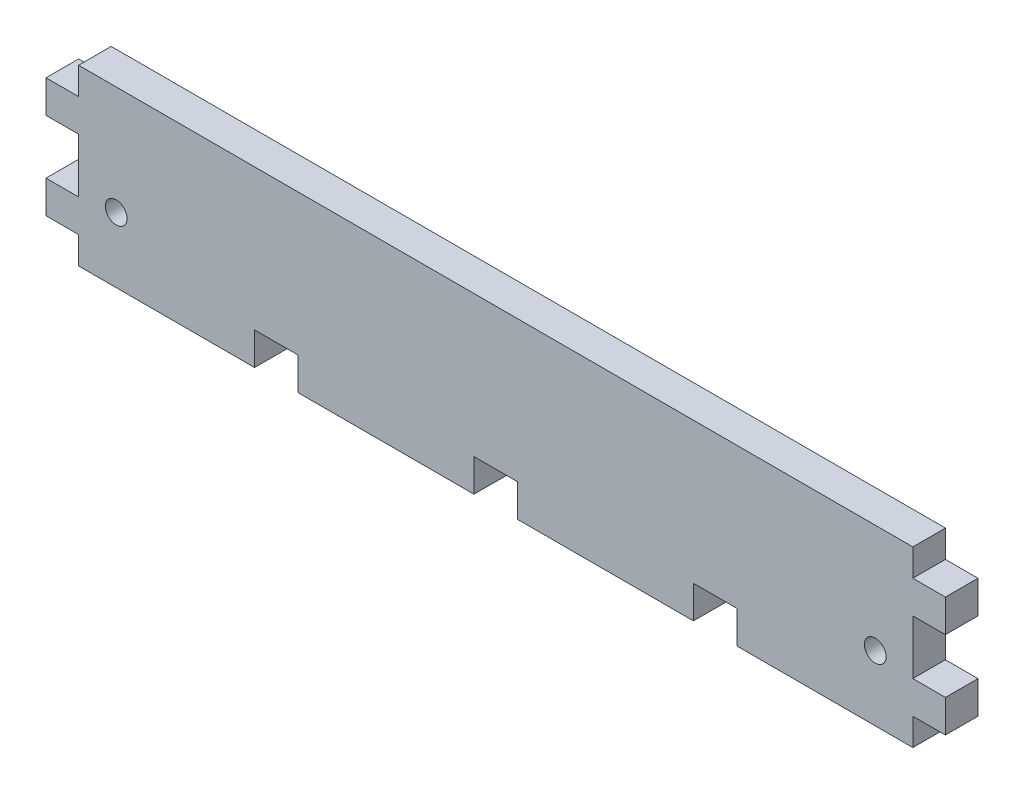
ISO-10303-21;
HEADER;
FILE_DESCRIPTION(('STEP AP214'),'2;1');
FILE_NAME('part.step','',(''),(''),'','','');
FILE_SCHEMA(('AUTOMOTIVE_DESIGN { 1 0 10303 214 1 1 1 1 }'));
ENDSEC;
DATA;
#1=APPLICATION_CONTEXT('core data for automotive mechanical design processes');
#2=APPLICATION_PROTOCOL_DEFINITION('international standard','automotive_design',2000,#1);
#3=PRODUCT_CONTEXT('',#1,'mechanical');
#4=PRODUCT('Part','Part','',(#3));
#5=PRODUCT_RELATED_PRODUCT_CATEGORY('part','',(#4));
#6=PRODUCT_DEFINITION_FORMATION('','',#4);
#7=PRODUCT_DEFINITION_CONTEXT('part definition',#1,'design');
#8=PRODUCT_DEFINITION('design','',#6,#7);
#9=PRODUCT_DEFINITION_SHAPE('','',#8);
#10=(LENGTH_UNIT() NAMED_UNIT(*) SI_UNIT(.MILLI.,.METRE.));
#11=(NAMED_UNIT(*) PLANE_ANGLE_UNIT() SI_UNIT($,.RADIAN.));
#12=(NAMED_UNIT(*) SI_UNIT($,.STERADIAN.) SOLID_ANGLE_UNIT());
#13=UNCERTAINTY_MEASURE_WITH_UNIT(LENGTH_MEASURE(1.E-05),#10,'distance_accuracy_value','');
#14=(GEOMETRIC_REPRESENTATION_CONTEXT(3) GLOBAL_UNCERTAINTY_ASSIGNED_CONTEXT((#13)) GLOBAL_UNIT_ASSIGNED_CONTEXT((#10,
#11,#12)) REPRESENTATION_CONTEXT('',''));
#15=CARTESIAN_POINT('',(0.,0.,0.));
#16=DIRECTION('',(0.,0.,1.));
#17=DIRECTION('',(1.,0.,0.));
#18=AXIS2_PLACEMENT_3D('',#15,#16,#17);
#19=CARTESIAN_POINT('',(0.,0.,15.));
#20=DIRECTION('',(0.,0.,-1.));
#21=DIRECTION('',(-1.,0.,0.));
#22=AXIS2_PLACEMENT_3D('',#19,#20,#21);
#23=PLANE('',#22);
#24=DIRECTION('',(1.,0.,0.));
#25=VECTOR('',#24,1.);
#26=CARTESIAN_POINT('',(81.,0.,15.));
#27=LINE('',#26,#25);
#28=CARTESIAN_POINT('',(0.,0.,15.));
#29=VERTEX_POINT('',#28);
#30=CARTESIAN_POINT('',(81.,0.,15.));
#31=VERTEX_POINT('',#30);
#32=EDGE_CURVE('E380',#29,#31,#27,.T.);
#33=ORIENTED_EDGE('',*,*,#32,.T.);
#34=DIRECTION('',(0.,1.,0.));
#35=VECTOR('',#34,1.);
#36=CARTESIAN_POINT('',(81.,15.,15.));
#37=LINE('',#36,#35);
#38=CARTESIAN_POINT('',(81.,15.,15.));
#39=VERTEX_POINT('',#38);
#40=EDGE_CURVE('E172',#31,#39,#37,.T.);
#41=ORIENTED_EDGE('',*,*,#40,.T.);
#42=DIRECTION('',(1.,0.,0.));
#43=VECTOR('',#42,1.);
#44=CARTESIAN_POINT('',(101.,15.,15.));
#45=LINE('',#44,#43);
#46=CARTESIAN_POINT('',(101.,15.,15.));
#47=VERTEX_POINT('',#46);
#48=EDGE_CURVE('E497',#39,#47,#45,.T.);
#49=ORIENTED_EDGE('',*,*,#48,.T.);
#50=DIRECTION('',(0.,-1.,0.));
#51=VECTOR('',#50,1.);
#52=CARTESIAN_POINT('',(101.,0.,15.));
#53=LINE('',#52,#51);
#54=CARTESIAN_POINT('',(101.,0.,15.));
#55=VERTEX_POINT('',#54);
#56=EDGE_CURVE('E517',#47,#55,#53,.T.);
#57=ORIENTED_EDGE('',*,*,#56,.T.);
#58=DIRECTION('',(1.,0.,0.));
#59=VECTOR('',#58,1.);
#60=CARTESIAN_POINT('',(182.,0.,15.));
#61=LINE('',#60,#59);
#62=CARTESIAN_POINT('',(182.,0.,15.));
#63=VERTEX_POINT('',#62);
#64=EDGE_CURVE('E513',#55,#63,#61,.T.);
#65=ORIENTED_EDGE('',*,*,#64,.T.);
#66=DIRECTION('',(0.,1.,0.));
#67=VECTOR('',#66,1.);
#68=CARTESIAN_POINT('',(182.,15.,15.));
#69=LINE('',#68,#67);
#70=CARTESIAN_POINT('',(182.,15.,15.));
#71=VERTEX_POINT('',#70);
#72=EDGE_CURVE('E516',#63,#71,#69,.T.);
#73=ORIENTED_EDGE('',*,*,#72,.T.);
#74=DIRECTION('',(1.,0.,0.));
#75=VECTOR('',#74,1.);
#76=CARTESIAN_POINT('',(202.,15.,15.));
#77=LINE('',#76,#75);
#78=CARTESIAN_POINT('',(202.,15.,15.));
#79=VERTEX_POINT('',#78);
#80=EDGE_CURVE('E521',#71,#79,#77,.T.);
#81=ORIENTED_EDGE('',*,*,#80,.T.);
#82=DIRECTION('',(0.,-1.,0.));
#83=VECTOR('',#82,1.);
#84=CARTESIAN_POINT('',(202.,0.,15.));
#85=LINE('',#84,#83);
#86=CARTESIAN_POINT('',(202.,0.,15.));
#87=VERTEX_POINT('',#86);
#88=EDGE_CURVE('E528',#79,#87,#85,.T.);
#89=ORIENTED_EDGE('',*,*,#88,.T.);
#90=DIRECTION('',(1.,0.,0.));
#91=VECTOR('',#90,1.);
#92=CARTESIAN_POINT('',(283.,0.,15.));
#93=LINE('',#92,#91);
#94=CARTESIAN_POINT('',(283.,0.,15.));
#95=VERTEX_POINT('',#94);
#96=EDGE_CURVE('E531',#87,#95,#93,.T.);
#97=ORIENTED_EDGE('',*,*,#96,.T.);
#98=DIRECTION('',(0.,1.,0.));
#99=VECTOR('',#98,1.);
#100=CARTESIAN_POINT('',(283.,15.,15.));
#101=LINE('',#100,#99);
#102=CARTESIAN_POINT('',(283.,15.,15.));
#103=VERTEX_POINT('',#102);
#104=EDGE_CURVE('E534',#95,#103,#101,.T.);
#105=ORIENTED_EDGE('',*,*,#104,.T.);
#106=DIRECTION('',(1.,0.,0.));
#107=VECTOR('',#106,1.);
#108=CARTESIAN_POINT('',(303.,15.,15.));
#109=LINE('',#108,#107);
#110=CARTESIAN_POINT('',(303.,15.,15.));
#111=VERTEX_POINT('',#110);
#112=EDGE_CURVE('E537',#103,#111,#109,.T.);
#113=ORIENTED_EDGE('',*,*,#112,.T.);
#114=DIRECTION('',(0.,-1.,0.));
#115=VECTOR('',#114,1.);
#116=CARTESIAN_POINT('',(303.,0.,15.));
#117=LINE('',#116,#115);
#118=CARTESIAN_POINT('',(303.,0.,15.));
#119=VERTEX_POINT('',#118);
#120=EDGE_CURVE('E540',#111,#119,#117,.T.);
#121=ORIENTED_EDGE('',*,*,#120,.T.);
#122=DIRECTION('',(1.,0.,0.));
#123=VECTOR('',#122,1.);
#124=CARTESIAN_POINT('',(384.,0.,15.));
#125=LINE('',#124,#123);
#126=CARTESIAN_POINT('',(384.,0.,15.));
#127=VERTEX_POINT('',#126);
#128=EDGE_CURVE('E543',#119,#127,#125,.T.);
#129=ORIENTED_EDGE('',*,*,#128,.T.);
#130=DIRECTION('',(0.,1.,0.));
#131=VECTOR('',#130,1.);
#132=CARTESIAN_POINT('',(384.,12.5,15.));
#133=LINE('',#132,#131);
#134=CARTESIAN_POINT('',(384.,12.5,15.));
#135=VERTEX_POINT('',#134);
#136=EDGE_CURVE('E546',#127,#135,#133,.T.);
#137=ORIENTED_EDGE('',*,*,#136,.T.);
#138=DIRECTION('',(1.,0.,0.));
#139=VECTOR('',#138,1.);
#140=CARTESIAN_POINT('',(399.,12.5,15.));
#141=LINE('',#140,#139);
#142=CARTESIAN_POINT('',(399.,12.5,15.));
#143=VERTEX_POINT('',#142);
#144=EDGE_CURVE('E549',#135,#143,#141,.T.);
#145=ORIENTED_EDGE('',*,*,#144,.T.);
#146=DIRECTION('',(0.,1.,0.));
#147=VECTOR('',#146,1.);
#148=CARTESIAN_POINT('',(399.,27.5,15.));
#149=LINE('',#148,#147);
#150=CARTESIAN_POINT('',(399.,27.5,15.));
#151=VERTEX_POINT('',#150);
#152=EDGE_CURVE('E552',#143,#151,#149,.T.);
#153=ORIENTED_EDGE('',*,*,#152,.T.);
#154=DIRECTION('',(-1.,0.,0.));
#155=VECTOR('',#154,1.);
#156=CARTESIAN_POINT('',(384.,27.5,15.));
#157=LINE('',#156,#155);
#158=CARTESIAN_POINT('',(384.,27.5,15.));
#159=VERTEX_POINT('',#158);
#160=EDGE_CURVE('E555',#151,#159,#157,.T.);
#161=ORIENTED_EDGE('',*,*,#160,.T.);
#162=DIRECTION('',(0.,1.,0.));
#163=VECTOR('',#162,1.);
#164=CARTESIAN_POINT('',(384.,52.5,15.));
#165=LINE('',#164,#163);
#166=CARTESIAN_POINT('',(384.,52.5,15.));
#167=VERTEX_POINT('',#166);
#168=EDGE_CURVE('E558',#159,#167,#165,.T.);
#169=ORIENTED_EDGE('',*,*,#168,.T.);
#170=DIRECTION('',(1.,0.,0.));
#171=VECTOR('',#170,1.);
#172=CARTESIAN_POINT('',(399.,52.5,15.));
#173=LINE('',#172,#171);
#174=CARTESIAN_POINT('',(399.,52.5,15.));
#175=VERTEX_POINT('',#174);
#176=EDGE_CURVE('E561',#167,#175,#173,.T.);
#177=ORIENTED_EDGE('',*,*,#176,.T.);
#178=DIRECTION('',(0.,1.,0.));
#179=VECTOR('',#178,1.);
#180=CARTESIAN_POINT('',(399.,67.5,15.));
#181=LINE('',#180,#179);
#182=CARTESIAN_POINT('',(399.,67.5,15.));
#183=VERTEX_POINT('',#182);
#184=EDGE_CURVE('E564',#175,#183,#181,.T.);
#185=ORIENTED_EDGE('',*,*,#184,.T.);
#186=DIRECTION('',(-1.,0.,0.));
#187=VECTOR('',#186,1.);
#188=CARTESIAN_POINT('',(384.,67.5,15.));
#189=LINE('',#188,#187);
#190=CARTESIAN_POINT('',(384.,67.5,15.));
#191=VERTEX_POINT('',#190);
#192=EDGE_CURVE('E567',#183,#191,#189,.T.);
#193=ORIENTED_EDGE('',*,*,#192,.T.);
#194=DIRECTION('',(0.,1.,0.));
#195=VECTOR('',#194,1.);
#196=CARTESIAN_POINT('',(384.,80.,15.));
#197=LINE('',#196,#195);
#198=CARTESIAN_POINT('',(384.,80.,15.));
#199=VERTEX_POINT('',#198);
#200=EDGE_CURVE('E570',#191,#199,#197,.T.);
#201=ORIENTED_EDGE('',*,*,#200,.T.);
#202=DIRECTION('',(-1.,0.,0.));
#203=VECTOR('',#202,1.);
#204=CARTESIAN_POINT('',(0.,80.,15.));
#205=LINE('',#204,#203);
#206=CARTESIAN_POINT('',(0.,80.,15.));
#207=VERTEX_POINT('',#206);
#208=EDGE_CURVE('E573',#199,#207,#205,.T.);
#209=ORIENTED_EDGE('',*,*,#208,.T.);
#210=DIRECTION('',(0.,-1.,0.));
#211=VECTOR('',#210,1.);
#212=CARTESIAN_POINT('',(0.,67.5,15.));
#213=LINE('',#212,#211);
#214=CARTESIAN_POINT('',(0.,67.5,15.));
#215=VERTEX_POINT('',#214);
#216=EDGE_CURVE('E576',#207,#215,#213,.T.);
#217=ORIENTED_EDGE('',*,*,#216,.T.);
#218=DIRECTION('',(-1.,0.,0.));
#219=VECTOR('',#218,1.);
#220=CARTESIAN_POINT('',(-15.,67.5,15.));
#221=LINE('',#220,#219);
#222=CARTESIAN_POINT('',(-15.,67.5,15.));
#223=VERTEX_POINT('',#222);
#224=EDGE_CURVE('E579',#215,#223,#221,.T.);
#225=ORIENTED_EDGE('',*,*,#224,.T.);
#226=DIRECTION('',(0.,-1.,0.));
#227=VECTOR('',#226,1.);
#228=CARTESIAN_POINT('',(-15.,52.5,15.));
#229=LINE('',#228,#227);
#230=CARTESIAN_POINT('',(-15.,52.5,15.));
#231=VERTEX_POINT('',#230);
#232=EDGE_CURVE('E582',#223,#231,#229,.T.);
#233=ORIENTED_EDGE('',*,*,#232,.T.);
#234=DIRECTION('',(1.,0.,0.));
#235=VECTOR('',#234,1.);
#236=CARTESIAN_POINT('',(0.,52.5,15.));
#237=LINE('',#236,#235);
#238=CARTESIAN_POINT('',(0.,52.5,15.));
#239=VERTEX_POINT('',#238);
#240=EDGE_CURVE('E585',#231,#239,#237,.T.);
#241=ORIENTED_EDGE('',*,*,#240,.T.);
#242=DIRECTION('',(0.,-1.,0.));
#243=VECTOR('',#242,1.);
#244=CARTESIAN_POINT('',(0.,27.5,15.));
#245=LINE('',#244,#243);
#246=CARTESIAN_POINT('',(0.,27.5,15.));
#247=VERTEX_POINT('',#246);
#248=EDGE_CURVE('E588',#239,#247,#245,.T.);
#249=ORIENTED_EDGE('',*,*,#248,.T.);
#250=DIRECTION('',(-1.,0.,0.));
#251=VECTOR('',#250,1.);
#252=CARTESIAN_POINT('',(-15.,27.5,15.));
#253=LINE('',#252,#251);
#254=CARTESIAN_POINT('',(-15.,27.5,15.));
#255=VERTEX_POINT('',#254);
#256=EDGE_CURVE('E263',#247,#255,#253,.T.);
#257=ORIENTED_EDGE('',*,*,#256,.T.);
#258=DIRECTION('',(0.,-1.,0.));
#259=VECTOR('',#258,1.);
#260=CARTESIAN_POINT('',(-15.,12.5,15.));
#261=LINE('',#260,#259);
#262=CARTESIAN_POINT('',(-15.,12.5,15.));
#263=VERTEX_POINT('',#262);
#264=EDGE_CURVE('E257',#255,#263,#261,.T.);
#265=ORIENTED_EDGE('',*,*,#264,.T.);
#266=DIRECTION('',(1.,0.,0.));
#267=VECTOR('',#266,1.);
#268=CARTESIAN_POINT('',(0.,12.5,15.));
#269=LINE('',#268,#267);
#270=CARTESIAN_POINT('',(0.,12.5,15.));
#271=VERTEX_POINT('',#270);
#272=EDGE_CURVE('E261',#263,#271,#269,.T.);
#273=ORIENTED_EDGE('',*,*,#272,.T.);
#274=DIRECTION('',(0.,-1.,0.));
#275=VECTOR('',#274,1.);
#276=CARTESIAN_POINT('',(0.,0.,15.));
#277=LINE('',#276,#275);
#278=EDGE_CURVE('E57',#271,#29,#277,.T.);
#279=ORIENTED_EDGE('',*,*,#278,.T.);
#280=EDGE_LOOP('',(#33,#41,#49,#57,#65,#73,#81,#89,#97,#105,#113,#121,#129,#137,#145,#153,#161,
#169,#177,#185,#193,#201,#209,#217,#225,#233,#241,#249,#257,#265,#273,#279));
#281=FACE_BOUND('',#280,.T.);
#282=CARTESIAN_POINT('',(17.3,30.,15.));
#283=DIRECTION('',(0.,0.,1.));
#284=DIRECTION('',(1.,0.,0.));
#285=AXIS2_PLACEMENT_3D('',#282,#283,#284);
#286=CIRCLE('',#285,5.);
#287=CARTESIAN_POINT('',(22.3,30.,15.));
#288=VERTEX_POINT('',#287);
#289=EDGE_CURVE('E290',#288,#288,#286,.T.);
#290=ORIENTED_EDGE('',*,*,#289,.F.);
#291=EDGE_LOOP('',(#290));
#292=FACE_BOUND('',#291,.T.);
#293=CARTESIAN_POINT('',(366.7,30.,15.));
#294=DIRECTION('',(0.,0.,1.));
#295=DIRECTION('',(-1.,0.,0.));
#296=AXIS2_PLACEMENT_3D('',#293,#294,#295);
#297=CIRCLE('',#296,4.99999999999999);
#298=CARTESIAN_POINT('',(361.7,30.,15.));
#299=VERTEX_POINT('',#298);
#300=EDGE_CURVE('E631',#299,#299,#297,.T.);
#301=ORIENTED_EDGE('',*,*,#300,.F.);
#302=EDGE_LOOP('',(#301));
#303=FACE_BOUND('',#302,.T.);
#304=ADVANCED_FACE('F39',(#281,#292,#303),#23,.F.);
#305=CARTESIAN_POINT('',(0.,0.,0.));
#306=DIRECTION('',(0.,0.,-1.));
#307=DIRECTION('',(-1.,0.,0.));
#308=AXIS2_PLACEMENT_3D('',#305,#306,#307);
#309=PLANE('',#308);
#310=CARTESIAN_POINT('',(17.3,30.,0.));
#311=DIRECTION('',(0.,0.,1.));
#312=DIRECTION('',(1.,0.,0.));
#313=AXIS2_PLACEMENT_3D('',#310,#311,#312);
#314=CIRCLE('',#313,5.);
#315=CARTESIAN_POINT('',(22.3,30.,0.));
#316=VERTEX_POINT('',#315);
#317=EDGE_CURVE('E638',#316,#316,#314,.T.);
#318=ORIENTED_EDGE('',*,*,#317,.T.);
#319=EDGE_LOOP('',(#318));
#320=FACE_BOUND('',#319,.T.);
#321=DIRECTION('',(1.,0.,0.));
#322=VECTOR('',#321,1.);
#323=CARTESIAN_POINT('',(81.,0.,0.));
#324=LINE('',#323,#322);
#325=CARTESIAN_POINT('',(0.,0.,0.));
#326=VERTEX_POINT('',#325);
#327=CARTESIAN_POINT('',(81.,0.,0.));
#328=VERTEX_POINT('',#327);
#329=EDGE_CURVE('E285',#326,#328,#324,.T.);
#330=ORIENTED_EDGE('',*,*,#329,.F.);
#331=DIRECTION('',(0.,-1.,0.));
#332=VECTOR('',#331,1.);
#333=CARTESIAN_POINT('',(0.,0.,0.));
#334=LINE('',#333,#332);
#335=CARTESIAN_POINT('',(0.,12.5,0.));
#336=VERTEX_POINT('',#335);
#337=EDGE_CURVE('E164',#336,#326,#334,.T.);
#338=ORIENTED_EDGE('',*,*,#337,.F.);
#339=DIRECTION('',(1.,0.,0.));
#340=VECTOR('',#339,1.);
#341=CARTESIAN_POINT('',(0.,12.5,0.));
#342=LINE('',#341,#340);
#343=CARTESIAN_POINT('',(-15.,12.5,0.));
#344=VERTEX_POINT('',#343);
#345=EDGE_CURVE('E158',#344,#336,#342,.T.);
#346=ORIENTED_EDGE('',*,*,#345,.F.);
#347=DIRECTION('',(0.,-1.,0.));
#348=VECTOR('',#347,1.);
#349=CARTESIAN_POINT('',(-15.,12.5,0.));
#350=LINE('',#349,#348);
#351=CARTESIAN_POINT('',(-15.,27.5,0.));
#352=VERTEX_POINT('',#351);
#353=EDGE_CURVE('E272',#352,#344,#350,.T.);
#354=ORIENTED_EDGE('',*,*,#353,.F.);
#355=DIRECTION('',(-1.,0.,0.));
#356=VECTOR('',#355,1.);
#357=CARTESIAN_POINT('',(-15.,27.5,0.));
#358=LINE('',#357,#356);
#359=CARTESIAN_POINT('',(0.,27.5,0.));
#360=VERTEX_POINT('',#359);
#361=EDGE_CURVE('E371',#360,#352,#358,.T.);
#362=ORIENTED_EDGE('',*,*,#361,.F.);
#363=DIRECTION('',(0.,-1.,0.));
#364=VECTOR('',#363,1.);
#365=CARTESIAN_POINT('',(0.,27.5,0.));
#366=LINE('',#365,#364);
#367=CARTESIAN_POINT('',(0.,52.5,0.));
#368=VERTEX_POINT('',#367);
#369=EDGE_CURVE('E368',#368,#360,#366,.T.);
#370=ORIENTED_EDGE('',*,*,#369,.F.);
#371=DIRECTION('',(1.,0.,0.));
#372=VECTOR('',#371,1.);
#373=CARTESIAN_POINT('',(0.,52.5,0.));
#374=LINE('',#373,#372);
#375=CARTESIAN_POINT('',(-15.,52.5,0.));
#376=VERTEX_POINT('',#375);
#377=EDGE_CURVE('E365',#376,#368,#374,.T.);
#378=ORIENTED_EDGE('',*,*,#377,.F.);
#379=DIRECTION('',(0.,-1.,0.));
#380=VECTOR('',#379,1.);
#381=CARTESIAN_POINT('',(-15.,52.5,0.));
#382=LINE('',#381,#380);
#383=CARTESIAN_POINT('',(-15.,67.5,0.));
#384=VERTEX_POINT('',#383);
#385=EDGE_CURVE('E362',#384,#376,#382,.T.);
#386=ORIENTED_EDGE('',*,*,#385,.F.);
#387=DIRECTION('',(-1.,0.,0.));
#388=VECTOR('',#387,1.);
#389=CARTESIAN_POINT('',(-15.,67.5,0.));
#390=LINE('',#389,#388);
#391=CARTESIAN_POINT('',(0.,67.5,0.));
#392=VERTEX_POINT('',#391);
#393=EDGE_CURVE('E359',#392,#384,#390,.T.);
#394=ORIENTED_EDGE('',*,*,#393,.F.);
#395=DIRECTION('',(0.,-1.,0.));
#396=VECTOR('',#395,1.);
#397=CARTESIAN_POINT('',(0.,67.5,0.));
#398=LINE('',#397,#396);
#399=CARTESIAN_POINT('',(0.,80.,0.));
#400=VERTEX_POINT('',#399);
#401=EDGE_CURVE('E356',#400,#392,#398,.T.);
#402=ORIENTED_EDGE('',*,*,#401,.F.);
#403=DIRECTION('',(-1.,0.,0.));
#404=VECTOR('',#403,1.);
#405=CARTESIAN_POINT('',(0.,80.,0.));
#406=LINE('',#405,#404);
#407=CARTESIAN_POINT('',(384.,80.,0.));
#408=VERTEX_POINT('',#407);
#409=EDGE_CURVE('E353',#408,#400,#406,.T.);
#410=ORIENTED_EDGE('',*,*,#409,.F.);
#411=DIRECTION('',(0.,1.,0.));
#412=VECTOR('',#411,1.);
#413=CARTESIAN_POINT('',(384.,80.,0.));
#414=LINE('',#413,#412);
#415=CARTESIAN_POINT('',(384.,67.5,0.));
#416=VERTEX_POINT('',#415);
#417=EDGE_CURVE('E350',#416,#408,#414,.T.);
#418=ORIENTED_EDGE('',*,*,#417,.F.);
#419=DIRECTION('',(-1.,0.,0.));
#420=VECTOR('',#419,1.);
#421=CARTESIAN_POINT('',(384.,67.5,0.));
#422=LINE('',#421,#420);
#423=CARTESIAN_POINT('',(399.,67.5,0.));
#424=VERTEX_POINT('',#423);
#425=EDGE_CURVE('E347',#424,#416,#422,.T.);
#426=ORIENTED_EDGE('',*,*,#425,.F.);
#427=DIRECTION('',(0.,1.,0.));
#428=VECTOR('',#427,1.);
#429=CARTESIAN_POINT('',(399.,67.5,0.));
#430=LINE('',#429,#428);
#431=CARTESIAN_POINT('',(399.,52.5,0.));
#432=VERTEX_POINT('',#431);
#433=EDGE_CURVE('E344',#432,#424,#430,.T.);
#434=ORIENTED_EDGE('',*,*,#433,.F.);
#435=DIRECTION('',(1.,0.,0.));
#436=VECTOR('',#435,1.);
#437=CARTESIAN_POINT('',(399.,52.5,0.));
#438=LINE('',#437,#436);
#439=CARTESIAN_POINT('',(384.,52.5,0.));
#440=VERTEX_POINT('',#439);
#441=EDGE_CURVE('E341',#440,#432,#438,.T.);
#442=ORIENTED_EDGE('',*,*,#441,.F.);
#443=DIRECTION('',(0.,1.,0.));
#444=VECTOR('',#443,1.);
#445=CARTESIAN_POINT('',(384.,52.5,0.));
#446=LINE('',#445,#444);
#447=CARTESIAN_POINT('',(384.,27.5,0.));
#448=VERTEX_POINT('',#447);
#449=EDGE_CURVE('E338',#448,#440,#446,.T.);
#450=ORIENTED_EDGE('',*,*,#449,.F.);
#451=DIRECTION('',(-1.,0.,0.));
#452=VECTOR('',#451,1.);
#453=CARTESIAN_POINT('',(384.,27.5,0.));
#454=LINE('',#453,#452);
#455=CARTESIAN_POINT('',(399.,27.5,0.));
#456=VERTEX_POINT('',#455);
#457=EDGE_CURVE('E335',#456,#448,#454,.T.);
#458=ORIENTED_EDGE('',*,*,#457,.F.);
#459=DIRECTION('',(0.,1.,0.));
#460=VECTOR('',#459,1.);
#461=CARTESIAN_POINT('',(399.,27.5,0.));
#462=LINE('',#461,#460);
#463=CARTESIAN_POINT('',(399.,12.5,0.));
#464=VERTEX_POINT('',#463);
#465=EDGE_CURVE('E332',#464,#456,#462,.T.);
#466=ORIENTED_EDGE('',*,*,#465,.F.);
#467=DIRECTION('',(1.,0.,0.));
#468=VECTOR('',#467,1.);
#469=CARTESIAN_POINT('',(399.,12.5,0.));
#470=LINE('',#469,#468);
#471=CARTESIAN_POINT('',(384.,12.5,0.));
#472=VERTEX_POINT('',#471);
#473=EDGE_CURVE('E329',#472,#464,#470,.T.);
#474=ORIENTED_EDGE('',*,*,#473,.F.);
#475=DIRECTION('',(0.,1.,0.));
#476=VECTOR('',#475,1.);
#477=CARTESIAN_POINT('',(384.,12.5,0.));
#478=LINE('',#477,#476);
#479=CARTESIAN_POINT('',(384.,0.,0.));
#480=VERTEX_POINT('',#479);
#481=EDGE_CURVE('E326',#480,#472,#478,.T.);
#482=ORIENTED_EDGE('',*,*,#481,.F.);
#483=DIRECTION('',(1.,0.,0.));
#484=VECTOR('',#483,1.);
#485=CARTESIAN_POINT('',(384.,0.,0.));
#486=LINE('',#485,#484);
#487=CARTESIAN_POINT('',(303.,0.,0.));
#488=VERTEX_POINT('',#487);
#489=EDGE_CURVE('E323',#488,#480,#486,.T.);
#490=ORIENTED_EDGE('',*,*,#489,.F.);
#491=DIRECTION('',(0.,-1.,0.));
#492=VECTOR('',#491,1.);
#493=CARTESIAN_POINT('',(303.,0.,0.));
#494=LINE('',#493,#492);
#495=CARTESIAN_POINT('',(303.,15.,0.));
#496=VERTEX_POINT('',#495);
#497=EDGE_CURVE('E320',#496,#488,#494,.T.);
#498=ORIENTED_EDGE('',*,*,#497,.F.);
#499=DIRECTION('',(1.,0.,0.));
#500=VECTOR('',#499,1.);
#501=CARTESIAN_POINT('',(303.,15.,0.));
#502=LINE('',#501,#500);
#503=CARTESIAN_POINT('',(283.,15.,0.));
#504=VERTEX_POINT('',#503);
#505=EDGE_CURVE('E317',#504,#496,#502,.T.);
#506=ORIENTED_EDGE('',*,*,#505,.F.);
#507=DIRECTION('',(0.,1.,0.));
#508=VECTOR('',#507,1.);
#509=CARTESIAN_POINT('',(283.,15.,0.));
#510=LINE('',#509,#508);
#511=CARTESIAN_POINT('',(283.,0.,0.));
#512=VERTEX_POINT('',#511);
#513=EDGE_CURVE('E314',#512,#504,#510,.T.);
#514=ORIENTED_EDGE('',*,*,#513,.F.);
#515=DIRECTION('',(1.,0.,0.));
#516=VECTOR('',#515,1.);
#517=CARTESIAN_POINT('',(283.,0.,0.));
#518=LINE('',#517,#516);
#519=CARTESIAN_POINT('',(202.,0.,0.));
#520=VERTEX_POINT('',#519);
#521=EDGE_CURVE('E311',#520,#512,#518,.T.);
#522=ORIENTED_EDGE('',*,*,#521,.F.);
#523=DIRECTION('',(0.,-1.,0.));
#524=VECTOR('',#523,1.);
#525=CARTESIAN_POINT('',(202.,0.,0.));
#526=LINE('',#525,#524);
#527=CARTESIAN_POINT('',(202.,15.,0.));
#528=VERTEX_POINT('',#527);
#529=EDGE_CURVE('E308',#528,#520,#526,.T.);
#530=ORIENTED_EDGE('',*,*,#529,.F.);
#531=DIRECTION('',(1.,0.,0.));
#532=VECTOR('',#531,1.);
#533=CARTESIAN_POINT('',(202.,15.,0.));
#534=LINE('',#533,#532);
#535=CARTESIAN_POINT('',(182.,15.,0.));
#536=VERTEX_POINT('',#535);
#537=EDGE_CURVE('E305',#536,#528,#534,.T.);
#538=ORIENTED_EDGE('',*,*,#537,.F.);
#539=DIRECTION('',(0.,1.,0.));
#540=VECTOR('',#539,1.);
#541=CARTESIAN_POINT('',(182.,15.,0.));
#542=LINE('',#541,#540);
#543=CARTESIAN_POINT('',(182.,0.,0.));
#544=VERTEX_POINT('',#543);
#545=EDGE_CURVE('E302',#544,#536,#542,.T.);
#546=ORIENTED_EDGE('',*,*,#545,.F.);
#547=DIRECTION('',(1.,0.,0.));
#548=VECTOR('',#547,1.);
#549=CARTESIAN_POINT('',(182.,0.,0.));
#550=LINE('',#549,#548);
#551=CARTESIAN_POINT('',(101.,0.,0.));
#552=VERTEX_POINT('',#551);
#553=EDGE_CURVE('E299',#552,#544,#550,.T.);
#554=ORIENTED_EDGE('',*,*,#553,.F.);
#555=DIRECTION('',(0.,-1.,0.));
#556=VECTOR('',#555,1.);
#557=CARTESIAN_POINT('',(101.,0.,0.));
#558=LINE('',#557,#556);
#559=CARTESIAN_POINT('',(101.,15.,0.));
#560=VERTEX_POINT('',#559);
#561=EDGE_CURVE('E296',#560,#552,#558,.T.);
#562=ORIENTED_EDGE('',*,*,#561,.F.);
#563=DIRECTION('',(1.,0.,0.));
#564=VECTOR('',#563,1.);
#565=CARTESIAN_POINT('',(101.,15.,0.));
#566=LINE('',#565,#564);
#567=CARTESIAN_POINT('',(81.,15.,0.));
#568=VERTEX_POINT('',#567);
#569=EDGE_CURVE('E293',#568,#560,#566,.T.);
#570=ORIENTED_EDGE('',*,*,#569,.F.);
#571=DIRECTION('',(0.,1.,0.));
#572=VECTOR('',#571,1.);
#573=CARTESIAN_POINT('',(81.,15.,0.));
#574=LINE('',#573,#572);
#575=EDGE_CURVE('E289',#328,#568,#574,.T.);
#576=ORIENTED_EDGE('',*,*,#575,.F.);
#577=EDGE_LOOP('',(#330,#338,#346,#354,#362,#370,#378,#386,#394,#402,#410,#418,#426,#434,#442,
#450,#458,#466,#474,#482,#490,#498,#506,#514,#522,#530,#538,#546,#554,#562,#570,#576));
#578=FACE_BOUND('',#577,.T.);
#579=CARTESIAN_POINT('',(366.7,30.,0.));
#580=DIRECTION('',(0.,0.,1.));
#581=DIRECTION('',(-1.,0.,0.));
#582=AXIS2_PLACEMENT_3D('',#579,#580,#581);
#583=CIRCLE('',#582,4.99999999999999);
#584=CARTESIAN_POINT('',(361.7,30.,0.));
#585=VERTEX_POINT('',#584);
#586=EDGE_CURVE('E634',#585,#585,#583,.T.);
#587=ORIENTED_EDGE('',*,*,#586,.T.);
#588=EDGE_LOOP('',(#587));
#589=FACE_BOUND('',#588,.T.);
#590=ADVANCED_FACE('F501',(#320,#578,#589),#309,.T.);
#591=CARTESIAN_POINT('',(81.,0.,15.));
#592=DIRECTION('',(0.,1.,0.));
#593=DIRECTION('',(-1.,0.,0.));
#594=AXIS2_PLACEMENT_3D('',#591,#592,#593);
#595=PLANE('',#594);
#596=ORIENTED_EDGE('',*,*,#329,.T.);
#597=DIRECTION('',(0.,0.,-1.));
#598=VECTOR('',#597,1.);
#599=CARTESIAN_POINT('',(81.,0.,15.));
#600=LINE('',#599,#598);
#601=EDGE_CURVE('E11',#31,#328,#600,.T.);
#602=ORIENTED_EDGE('',*,*,#601,.F.);
#603=ORIENTED_EDGE('',*,*,#32,.F.);
#604=DIRECTION('',(0.,0.,-1.));
#605=VECTOR('',#604,1.);
#606=CARTESIAN_POINT('',(0.,0.,15.));
#607=LINE('',#606,#605);
#608=EDGE_CURVE('E281',#29,#326,#607,.T.);
#609=ORIENTED_EDGE('',*,*,#608,.T.);
#610=EDGE_LOOP('',(#596,#602,#603,#609));
#611=FACE_BOUND('',#610,.T.);
#612=ADVANCED_FACE('F41',(#611),#595,.F.);
#613=CARTESIAN_POINT('',(81.,15.,15.));
#614=DIRECTION('',(-1.,0.,0.));
#615=DIRECTION('',(0.,0.,1.));
#616=AXIS2_PLACEMENT_3D('',#613,#614,#615);
#617=PLANE('',#616);
#618=ORIENTED_EDGE('',*,*,#575,.T.);
#619=DIRECTION('',(0.,0.,-1.));
#620=VECTOR('',#619,1.);
#621=CARTESIAN_POINT('',(81.,15.,15.));
#622=LINE('',#621,#620);
#623=EDGE_CURVE('E49',#39,#568,#622,.T.);
#624=ORIENTED_EDGE('',*,*,#623,.F.);
#625=ORIENTED_EDGE('',*,*,#40,.F.);
#626=ORIENTED_EDGE('',*,*,#601,.T.);
#627=EDGE_LOOP('',(#618,#624,#625,#626));
#628=FACE_BOUND('',#627,.T.);
#629=ADVANCED_FACE('F938',(#628),#617,.F.);
#630=CARTESIAN_POINT('',(101.,15.,15.));
#631=DIRECTION('',(0.,1.,0.));
#632=DIRECTION('',(0.,0.,1.));
#633=AXIS2_PLACEMENT_3D('',#630,#631,#632);
#634=PLANE('',#633);
#635=ORIENTED_EDGE('',*,*,#569,.T.);
#636=DIRECTION('',(0.,0.,-1.));
#637=VECTOR('',#636,1.);
#638=CARTESIAN_POINT('',(101.,15.,15.));
#639=LINE('',#638,#637);
#640=EDGE_CURVE('E487',#47,#560,#639,.T.);
#641=ORIENTED_EDGE('',*,*,#640,.F.);
#642=ORIENTED_EDGE('',*,*,#48,.F.);
#643=ORIENTED_EDGE('',*,*,#623,.T.);
#644=EDGE_LOOP('',(#635,#641,#642,#643));
#645=FACE_BOUND('',#644,.T.);
#646=ADVANCED_FACE('F495',(#645),#634,.F.);
#647=CARTESIAN_POINT('',(101.,0.,15.));
#648=DIRECTION('',(1.,0.,0.));
#649=DIRECTION('',(0.,0.,-1.));
#650=AXIS2_PLACEMENT_3D('',#647,#648,#649);
#651=PLANE('',#650);
#652=ORIENTED_EDGE('',*,*,#561,.T.);
#653=DIRECTION('',(0.,0.,-1.));
#654=VECTOR('',#653,1.);
#655=CARTESIAN_POINT('',(101.,0.,15.));
#656=LINE('',#655,#654);
#657=EDGE_CURVE('E483',#55,#552,#656,.T.);
#658=ORIENTED_EDGE('',*,*,#657,.F.);
#659=ORIENTED_EDGE('',*,*,#56,.F.);
#660=ORIENTED_EDGE('',*,*,#640,.T.);
#661=EDGE_LOOP('',(#652,#658,#659,#660));
#662=FACE_BOUND('',#661,.T.);
#663=ADVANCED_FACE('F507',(#662),#651,.F.);
#664=CARTESIAN_POINT('',(182.,0.,15.));
#665=DIRECTION('',(0.,1.,0.));
#666=DIRECTION('',(-1.,0.,0.));
#667=AXIS2_PLACEMENT_3D('',#664,#665,#666);
#668=PLANE('',#667);
#669=ORIENTED_EDGE('',*,*,#553,.T.);
#670=DIRECTION('',(0.,0.,-1.));
#671=VECTOR('',#670,1.);
#672=CARTESIAN_POINT('',(182.,0.,15.));
#673=LINE('',#672,#671);
#674=EDGE_CURVE('E479',#63,#544,#673,.T.);
#675=ORIENTED_EDGE('',*,*,#674,.F.);
#676=ORIENTED_EDGE('',*,*,#64,.F.);
#677=ORIENTED_EDGE('',*,*,#657,.T.);
#678=EDGE_LOOP('',(#669,#675,#676,#677));
#679=FACE_BOUND('',#678,.T.);
#680=ADVANCED_FACE('F511',(#679),#668,.F.);
#681=CARTESIAN_POINT('',(182.,15.,15.));
#682=DIRECTION('',(-1.,0.,0.));
#683=DIRECTION('',(0.,0.,1.));
#684=AXIS2_PLACEMENT_3D('',#681,#682,#683);
#685=PLANE('',#684);
#686=ORIENTED_EDGE('',*,*,#545,.T.);
#687=DIRECTION('',(0.,0.,-1.));
#688=VECTOR('',#687,1.);
#689=CARTESIAN_POINT('',(182.,15.,15.));
#690=LINE('',#689,#688);
#691=EDGE_CURVE('E475',#71,#536,#690,.T.);
#692=ORIENTED_EDGE('',*,*,#691,.F.);
#693=ORIENTED_EDGE('',*,*,#72,.F.);
#694=ORIENTED_EDGE('',*,*,#674,.T.);
#695=EDGE_LOOP('',(#686,#692,#693,#694));
#696=FACE_BOUND('',#695,.T.);
#697=ADVANCED_FACE('F903',(#696),#685,.F.);
#698=CARTESIAN_POINT('',(202.,15.,15.));
#699=DIRECTION('',(0.,1.,0.));
#700=DIRECTION('',(-1.,0.,0.));
#701=AXIS2_PLACEMENT_3D('',#698,#699,#700);
#702=PLANE('',#701);
#703=ORIENTED_EDGE('',*,*,#537,.T.);
#704=DIRECTION('',(0.,0.,-1.));
#705=VECTOR('',#704,1.);
#706=CARTESIAN_POINT('',(202.,15.,15.));
#707=LINE('',#706,#705);
#708=EDGE_CURVE('E471',#79,#528,#707,.T.);
#709=ORIENTED_EDGE('',*,*,#708,.F.);
#710=ORIENTED_EDGE('',*,*,#80,.F.);
#711=ORIENTED_EDGE('',*,*,#691,.T.);
#712=EDGE_LOOP('',(#703,#709,#710,#711));
#713=FACE_BOUND('',#712,.T.);
#714=ADVANCED_FACE('F893',(#713),#702,.F.);
#715=CARTESIAN_POINT('',(202.,0.,15.));
#716=DIRECTION('',(1.,0.,0.));
#717=DIRECTION('',(0.,0.,-1.));
#718=AXIS2_PLACEMENT_3D('',#715,#716,#717);
#719=PLANE('',#718);
#720=ORIENTED_EDGE('',*,*,#529,.T.);
#721=DIRECTION('',(0.,0.,-1.));
#722=VECTOR('',#721,1.);
#723=CARTESIAN_POINT('',(202.,0.,15.));
#724=LINE('',#723,#722);
#725=EDGE_CURVE('E467',#87,#520,#724,.T.);
#726=ORIENTED_EDGE('',*,*,#725,.F.);
#727=ORIENTED_EDGE('',*,*,#88,.F.);
#728=ORIENTED_EDGE('',*,*,#708,.T.);
#729=EDGE_LOOP('',(#720,#726,#727,#728));
#730=FACE_BOUND('',#729,.T.);
#731=ADVANCED_FACE('F883',(#730),#719,.F.);
#732=CARTESIAN_POINT('',(283.,0.,15.));
#733=DIRECTION('',(0.,1.,0.));
#734=DIRECTION('',(-1.,0.,0.));
#735=AXIS2_PLACEMENT_3D('',#732,#733,#734);
#736=PLANE('',#735);
#737=ORIENTED_EDGE('',*,*,#521,.T.);
#738=DIRECTION('',(0.,0.,-1.));
#739=VECTOR('',#738,1.);
#740=CARTESIAN_POINT('',(283.,0.,15.));
#741=LINE('',#740,#739);
#742=EDGE_CURVE('E463',#95,#512,#741,.T.);
#743=ORIENTED_EDGE('',*,*,#742,.F.);
#744=ORIENTED_EDGE('',*,*,#96,.F.);
#745=ORIENTED_EDGE('',*,*,#725,.T.);
#746=EDGE_LOOP('',(#737,#743,#744,#745));
#747=FACE_BOUND('',#746,.T.);
#748=ADVANCED_FACE('F873',(#747),#736,.F.);
#749=CARTESIAN_POINT('',(283.,15.,15.));
#750=DIRECTION('',(-1.,0.,0.));
#751=DIRECTION('',(0.,0.,1.));
#752=AXIS2_PLACEMENT_3D('',#749,#750,#751);
#753=PLANE('',#752);
#754=ORIENTED_EDGE('',*,*,#513,.T.);
#755=DIRECTION('',(0.,0.,-1.));
#756=VECTOR('',#755,1.);
#757=CARTESIAN_POINT('',(283.,15.,15.));
#758=LINE('',#757,#756);
#759=EDGE_CURVE('E459',#103,#504,#758,.T.);
#760=ORIENTED_EDGE('',*,*,#759,.F.);
#761=ORIENTED_EDGE('',*,*,#104,.F.);
#762=ORIENTED_EDGE('',*,*,#742,.T.);
#763=EDGE_LOOP('',(#754,#760,#761,#762));
#764=FACE_BOUND('',#763,.T.);
#765=ADVANCED_FACE('F863',(#764),#753,.F.);
#766=CARTESIAN_POINT('',(303.,15.,15.));
#767=DIRECTION('',(0.,1.,0.));
#768=DIRECTION('',(-1.,0.,0.));
#769=AXIS2_PLACEMENT_3D('',#766,#767,#768);
#770=PLANE('',#769);
#771=ORIENTED_EDGE('',*,*,#505,.T.);
#772=DIRECTION('',(0.,0.,-1.));
#773=VECTOR('',#772,1.);
#774=CARTESIAN_POINT('',(303.,15.,15.));
#775=LINE('',#774,#773);
#776=EDGE_CURVE('E455',#111,#496,#775,.T.);
#777=ORIENTED_EDGE('',*,*,#776,.F.);
#778=ORIENTED_EDGE('',*,*,#112,.F.);
#779=ORIENTED_EDGE('',*,*,#759,.T.);
#780=EDGE_LOOP('',(#771,#777,#778,#779));
#781=FACE_BOUND('',#780,.T.);
#782=ADVANCED_FACE('F853',(#781),#770,.F.);
#783=CARTESIAN_POINT('',(303.,0.,15.));
#784=DIRECTION('',(1.,0.,0.));
#785=DIRECTION('',(0.,0.,-1.));
#786=AXIS2_PLACEMENT_3D('',#783,#784,#785);
#787=PLANE('',#786);
#788=ORIENTED_EDGE('',*,*,#497,.T.);
#789=DIRECTION('',(0.,0.,-1.));
#790=VECTOR('',#789,1.);
#791=CARTESIAN_POINT('',(303.,0.,15.));
#792=LINE('',#791,#790);
#793=EDGE_CURVE('E451',#119,#488,#792,.T.);
#794=ORIENTED_EDGE('',*,*,#793,.F.);
#795=ORIENTED_EDGE('',*,*,#120,.F.);
#796=ORIENTED_EDGE('',*,*,#776,.T.);
#797=EDGE_LOOP('',(#788,#794,#795,#796));
#798=FACE_BOUND('',#797,.T.);
#799=ADVANCED_FACE('F843',(#798),#787,.F.);
#800=CARTESIAN_POINT('',(384.,0.,15.));
#801=DIRECTION('',(0.,1.,0.));
#802=DIRECTION('',(-1.,0.,0.));
#803=AXIS2_PLACEMENT_3D('',#800,#801,#802);
#804=PLANE('',#803);
#805=ORIENTED_EDGE('',*,*,#489,.T.);
#806=DIRECTION('',(0.,0.,-1.));
#807=VECTOR('',#806,1.);
#808=CARTESIAN_POINT('',(384.,0.,15.));
#809=LINE('',#808,#807);
#810=EDGE_CURVE('E447',#127,#480,#809,.T.);
#811=ORIENTED_EDGE('',*,*,#810,.F.);
#812=ORIENTED_EDGE('',*,*,#128,.F.);
#813=ORIENTED_EDGE('',*,*,#793,.T.);
#814=EDGE_LOOP('',(#805,#811,#812,#813));
#815=FACE_BOUND('',#814,.T.);
#816=ADVANCED_FACE('F833',(#815),#804,.F.);
#817=CARTESIAN_POINT('',(384.,12.5,15.));
#818=DIRECTION('',(-1.,0.,0.));
#819=DIRECTION('',(0.,0.,1.));
#820=AXIS2_PLACEMENT_3D('',#817,#818,#819);
#821=PLANE('',#820);
#822=ORIENTED_EDGE('',*,*,#481,.T.);
#823=DIRECTION('',(0.,0.,-1.));
#824=VECTOR('',#823,1.);
#825=CARTESIAN_POINT('',(384.,12.5,15.));
#826=LINE('',#825,#824);
#827=EDGE_CURVE('E443',#135,#472,#826,.T.);
#828=ORIENTED_EDGE('',*,*,#827,.F.);
#829=ORIENTED_EDGE('',*,*,#136,.F.);
#830=ORIENTED_EDGE('',*,*,#810,.T.);
#831=EDGE_LOOP('',(#822,#828,#829,#830));
#832=FACE_BOUND('',#831,.T.);
#833=ADVANCED_FACE('F823',(#832),#821,.F.);
#834=CARTESIAN_POINT('',(399.,12.5,15.));
#835=DIRECTION('',(0.,1.,0.));
#836=DIRECTION('',(-1.,0.,0.));
#837=AXIS2_PLACEMENT_3D('',#834,#835,#836);
#838=PLANE('',#837);
#839=ORIENTED_EDGE('',*,*,#473,.T.);
#840=DIRECTION('',(0.,0.,-1.));
#841=VECTOR('',#840,1.);
#842=CARTESIAN_POINT('',(399.,12.5,15.));
#843=LINE('',#842,#841);
#844=EDGE_CURVE('E439',#143,#464,#843,.T.);
#845=ORIENTED_EDGE('',*,*,#844,.F.);
#846=ORIENTED_EDGE('',*,*,#144,.F.);
#847=ORIENTED_EDGE('',*,*,#827,.T.);
#848=EDGE_LOOP('',(#839,#845,#846,#847));
#849=FACE_BOUND('',#848,.T.);
#850=ADVANCED_FACE('F813',(#849),#838,.F.);
#851=CARTESIAN_POINT('',(399.,27.5,15.));
#852=DIRECTION('',(-1.,0.,0.));
#853=DIRECTION('',(0.,0.,1.));
#854=AXIS2_PLACEMENT_3D('',#851,#852,#853);
#855=PLANE('',#854);
#856=ORIENTED_EDGE('',*,*,#465,.T.);
#857=DIRECTION('',(0.,0.,-1.));
#858=VECTOR('',#857,1.);
#859=CARTESIAN_POINT('',(399.,27.5,15.));
#860=LINE('',#859,#858);
#861=EDGE_CURVE('E435',#151,#456,#860,.T.);
#862=ORIENTED_EDGE('',*,*,#861,.F.);
#863=ORIENTED_EDGE('',*,*,#152,.F.);
#864=ORIENTED_EDGE('',*,*,#844,.T.);
#865=EDGE_LOOP('',(#856,#862,#863,#864));
#866=FACE_BOUND('',#865,.T.);
#867=ADVANCED_FACE('F803',(#866),#855,.F.);
#868=CARTESIAN_POINT('',(384.,27.5,15.));
#869=DIRECTION('',(0.,-1.,0.));
#870=DIRECTION('',(0.,0.,-1.));
#871=AXIS2_PLACEMENT_3D('',#868,#869,#870);
#872=PLANE('',#871);
#873=ORIENTED_EDGE('',*,*,#457,.T.);
#874=DIRECTION('',(0.,0.,-1.));
#875=VECTOR('',#874,1.);
#876=CARTESIAN_POINT('',(384.,27.5,15.));
#877=LINE('',#876,#875);
#878=EDGE_CURVE('E431',#159,#448,#877,.T.);
#879=ORIENTED_EDGE('',*,*,#878,.F.);
#880=ORIENTED_EDGE('',*,*,#160,.F.);
#881=ORIENTED_EDGE('',*,*,#861,.T.);
#882=EDGE_LOOP('',(#873,#879,#880,#881));
#883=FACE_BOUND('',#882,.T.);
#884=ADVANCED_FACE('F793',(#883),#872,.F.);
#885=CARTESIAN_POINT('',(384.,52.5,15.));
#886=DIRECTION('',(-1.,0.,0.));
#887=DIRECTION('',(0.,0.,1.));
#888=AXIS2_PLACEMENT_3D('',#885,#886,#887);
#889=PLANE('',#888);
#890=ORIENTED_EDGE('',*,*,#449,.T.);
#891=DIRECTION('',(0.,0.,-1.));
#892=VECTOR('',#891,1.);
#893=CARTESIAN_POINT('',(384.,52.5,15.));
#894=LINE('',#893,#892);
#895=EDGE_CURVE('E427',#167,#440,#894,.T.);
#896=ORIENTED_EDGE('',*,*,#895,.F.);
#897=ORIENTED_EDGE('',*,*,#168,.F.);
#898=ORIENTED_EDGE('',*,*,#878,.T.);
#899=EDGE_LOOP('',(#890,#896,#897,#898));
#900=FACE_BOUND('',#899,.T.);
#901=ADVANCED_FACE('F783',(#900),#889,.F.);
#902=CARTESIAN_POINT('',(399.,52.5,15.));
#903=DIRECTION('',(0.,1.,0.));
#904=DIRECTION('',(-1.,0.,0.));
#905=AXIS2_PLACEMENT_3D('',#902,#903,#904);
#906=PLANE('',#905);
#907=ORIENTED_EDGE('',*,*,#441,.T.);
#908=DIRECTION('',(0.,0.,-1.));
#909=VECTOR('',#908,1.);
#910=CARTESIAN_POINT('',(399.,52.5,15.));
#911=LINE('',#910,#909);
#912=EDGE_CURVE('E423',#175,#432,#911,.T.);
#913=ORIENTED_EDGE('',*,*,#912,.F.);
#914=ORIENTED_EDGE('',*,*,#176,.F.);
#915=ORIENTED_EDGE('',*,*,#895,.T.);
#916=EDGE_LOOP('',(#907,#913,#914,#915));
#917=FACE_BOUND('',#916,.T.);
#918=ADVANCED_FACE('F773',(#917),#906,.F.);
#919=CARTESIAN_POINT('',(399.,67.5,15.));
#920=DIRECTION('',(-1.,0.,0.));
#921=DIRECTION('',(0.,0.,1.));
#922=AXIS2_PLACEMENT_3D('',#919,#920,#921);
#923=PLANE('',#922);
#924=ORIENTED_EDGE('',*,*,#433,.T.);
#925=DIRECTION('',(0.,0.,-1.));
#926=VECTOR('',#925,1.);
#927=CARTESIAN_POINT('',(399.,67.5,15.));
#928=LINE('',#927,#926);
#929=EDGE_CURVE('E419',#183,#424,#928,.T.);
#930=ORIENTED_EDGE('',*,*,#929,.F.);
#931=ORIENTED_EDGE('',*,*,#184,.F.);
#932=ORIENTED_EDGE('',*,*,#912,.T.);
#933=EDGE_LOOP('',(#924,#930,#931,#932));
#934=FACE_BOUND('',#933,.T.);
#935=ADVANCED_FACE('F763',(#934),#923,.F.);
#936=CARTESIAN_POINT('',(384.,67.5,15.));
#937=DIRECTION('',(0.,-1.,0.));
#938=DIRECTION('',(0.,0.,-1.));
#939=AXIS2_PLACEMENT_3D('',#936,#937,#938);
#940=PLANE('',#939);
#941=ORIENTED_EDGE('',*,*,#425,.T.);
#942=DIRECTION('',(0.,0.,-1.));
#943=VECTOR('',#942,1.);
#944=CARTESIAN_POINT('',(384.,67.5,15.));
#945=LINE('',#944,#943);
#946=EDGE_CURVE('E415',#191,#416,#945,.T.);
#947=ORIENTED_EDGE('',*,*,#946,.F.);
#948=ORIENTED_EDGE('',*,*,#192,.F.);
#949=ORIENTED_EDGE('',*,*,#929,.T.);
#950=EDGE_LOOP('',(#941,#947,#948,#949));
#951=FACE_BOUND('',#950,.T.);
#952=ADVANCED_FACE('F753',(#951),#940,.F.);
#953=CARTESIAN_POINT('',(384.,80.,15.));
#954=DIRECTION('',(-1.,0.,0.));
#955=DIRECTION('',(0.,0.,1.));
#956=AXIS2_PLACEMENT_3D('',#953,#954,#955);
#957=PLANE('',#956);
#958=ORIENTED_EDGE('',*,*,#417,.T.);
#959=DIRECTION('',(0.,0.,-1.));
#960=VECTOR('',#959,1.);
#961=CARTESIAN_POINT('',(384.,80.,15.));
#962=LINE('',#961,#960);
#963=EDGE_CURVE('E411',#199,#408,#962,.T.);
#964=ORIENTED_EDGE('',*,*,#963,.F.);
#965=ORIENTED_EDGE('',*,*,#200,.F.);
#966=ORIENTED_EDGE('',*,*,#946,.T.);
#967=EDGE_LOOP('',(#958,#964,#965,#966));
#968=FACE_BOUND('',#967,.T.);
#969=ADVANCED_FACE('F743',(#968),#957,.F.);
#970=CARTESIAN_POINT('',(0.,80.,15.));
#971=DIRECTION('',(0.,-1.,0.));
#972=DIRECTION('',(0.,0.,-1.));
#973=AXIS2_PLACEMENT_3D('',#970,#971,#972);
#974=PLANE('',#973);
#975=ORIENTED_EDGE('',*,*,#409,.T.);
#976=DIRECTION('',(0.,0.,-1.));
#977=VECTOR('',#976,1.);
#978=CARTESIAN_POINT('',(0.,80.,15.));
#979=LINE('',#978,#977);
#980=EDGE_CURVE('E407',#207,#400,#979,.T.);
#981=ORIENTED_EDGE('',*,*,#980,.F.);
#982=ORIENTED_EDGE('',*,*,#208,.F.);
#983=ORIENTED_EDGE('',*,*,#963,.T.);
#984=EDGE_LOOP('',(#975,#981,#982,#983));
#985=FACE_BOUND('',#984,.T.);
#986=ADVANCED_FACE('F733',(#985),#974,.F.);
#987=CARTESIAN_POINT('',(0.,67.5,15.));
#988=DIRECTION('',(1.,0.,0.));
#989=DIRECTION('',(0.,0.,-1.));
#990=AXIS2_PLACEMENT_3D('',#987,#988,#989);
#991=PLANE('',#990);
#992=ORIENTED_EDGE('',*,*,#401,.T.);
#993=DIRECTION('',(0.,0.,-1.));
#994=VECTOR('',#993,1.);
#995=CARTESIAN_POINT('',(0.,67.5,15.));
#996=LINE('',#995,#994);
#997=EDGE_CURVE('E403',#215,#392,#996,.T.);
#998=ORIENTED_EDGE('',*,*,#997,.F.);
#999=ORIENTED_EDGE('',*,*,#216,.F.);
#1000=ORIENTED_EDGE('',*,*,#980,.T.);
#1001=EDGE_LOOP('',(#992,#998,#999,#1000));
#1002=FACE_BOUND('',#1001,.T.);
#1003=ADVANCED_FACE('F723',(#1002),#991,.F.);
#1004=CARTESIAN_POINT('',(-15.,67.5,15.));
#1005=DIRECTION('',(0.,-1.,0.));
#1006=DIRECTION('',(0.,0.,-1.));
#1007=AXIS2_PLACEMENT_3D('',#1004,#1005,#1006);
#1008=PLANE('',#1007);
#1009=ORIENTED_EDGE('',*,*,#393,.T.);
#1010=DIRECTION('',(0.,0.,-1.));
#1011=VECTOR('',#1010,1.);
#1012=CARTESIAN_POINT('',(-15.,67.5,15.));
#1013=LINE('',#1012,#1011);
#1014=EDGE_CURVE('E399',#223,#384,#1013,.T.);
#1015=ORIENTED_EDGE('',*,*,#1014,.F.);
#1016=ORIENTED_EDGE('',*,*,#224,.F.);
#1017=ORIENTED_EDGE('',*,*,#997,.T.);
#1018=EDGE_LOOP('',(#1009,#1015,#1016,#1017));
#1019=FACE_BOUND('',#1018,.T.);
#1020=ADVANCED_FACE('F713',(#1019),#1008,.F.);
#1021=CARTESIAN_POINT('',(-15.,52.5,15.));
#1022=DIRECTION('',(1.,0.,0.));
#1023=DIRECTION('',(0.,0.,-1.));
#1024=AXIS2_PLACEMENT_3D('',#1021,#1022,#1023);
#1025=PLANE('',#1024);
#1026=ORIENTED_EDGE('',*,*,#385,.T.);
#1027=DIRECTION('',(0.,0.,-1.));
#1028=VECTOR('',#1027,1.);
#1029=CARTESIAN_POINT('',(-15.,52.5,15.));
#1030=LINE('',#1029,#1028);
#1031=EDGE_CURVE('E395',#231,#376,#1030,.T.);
#1032=ORIENTED_EDGE('',*,*,#1031,.F.);
#1033=ORIENTED_EDGE('',*,*,#232,.F.);
#1034=ORIENTED_EDGE('',*,*,#1014,.T.);
#1035=EDGE_LOOP('',(#1026,#1032,#1033,#1034));
#1036=FACE_BOUND('',#1035,.T.);
#1037=ADVANCED_FACE('F703',(#1036),#1025,.F.);
#1038=CARTESIAN_POINT('',(0.,52.5,15.));
#1039=DIRECTION('',(0.,1.,0.));
#1040=DIRECTION('',(0.,0.,1.));
#1041=AXIS2_PLACEMENT_3D('',#1038,#1039,#1040);
#1042=PLANE('',#1041);
#1043=ORIENTED_EDGE('',*,*,#377,.T.);
#1044=DIRECTION('',(0.,0.,-1.));
#1045=VECTOR('',#1044,1.);
#1046=CARTESIAN_POINT('',(0.,52.5,15.));
#1047=LINE('',#1046,#1045);
#1048=EDGE_CURVE('E391',#239,#368,#1047,.T.);
#1049=ORIENTED_EDGE('',*,*,#1048,.F.);
#1050=ORIENTED_EDGE('',*,*,#240,.F.);
#1051=ORIENTED_EDGE('',*,*,#1031,.T.);
#1052=EDGE_LOOP('',(#1043,#1049,#1050,#1051));
#1053=FACE_BOUND('',#1052,.T.);
#1054=ADVANCED_FACE('F694',(#1053),#1042,.F.);
#1055=CARTESIAN_POINT('',(0.,27.5,15.));
#1056=DIRECTION('',(1.,0.,0.));
#1057=DIRECTION('',(0.,0.,-1.));
#1058=AXIS2_PLACEMENT_3D('',#1055,#1056,#1057);
#1059=PLANE('',#1058);
#1060=ORIENTED_EDGE('',*,*,#369,.T.);
#1061=DIRECTION('',(0.,0.,-1.));
#1062=VECTOR('',#1061,1.);
#1063=CARTESIAN_POINT('',(0.,27.5,15.));
#1064=LINE('',#1063,#1062);
#1065=EDGE_CURVE('E387',#247,#360,#1064,.T.);
#1066=ORIENTED_EDGE('',*,*,#1065,.F.);
#1067=ORIENTED_EDGE('',*,*,#248,.F.);
#1068=ORIENTED_EDGE('',*,*,#1048,.T.);
#1069=EDGE_LOOP('',(#1060,#1066,#1067,#1068));
#1070=FACE_BOUND('',#1069,.T.);
#1071=ADVANCED_FACE('F596',(#1070),#1059,.F.);
#1072=CARTESIAN_POINT('',(-15.,27.5,15.));
#1073=DIRECTION('',(0.,-1.,0.));
#1074=DIRECTION('',(0.,0.,-1.));
#1075=AXIS2_PLACEMENT_3D('',#1072,#1073,#1074);
#1076=PLANE('',#1075);
#1077=ORIENTED_EDGE('',*,*,#361,.T.);
#1078=DIRECTION('',(0.,0.,-1.));
#1079=VECTOR('',#1078,1.);
#1080=CARTESIAN_POINT('',(-15.,27.5,15.));
#1081=LINE('',#1080,#1079);
#1082=EDGE_CURVE('E274',#255,#352,#1081,.T.);
#1083=ORIENTED_EDGE('',*,*,#1082,.F.);
#1084=ORIENTED_EDGE('',*,*,#256,.F.);
#1085=ORIENTED_EDGE('',*,*,#1065,.T.);
#1086=EDGE_LOOP('',(#1077,#1083,#1084,#1085));
#1087=FACE_BOUND('',#1086,.T.);
#1088=ADVANCED_FACE('F600',(#1087),#1076,.F.);
#1089=CARTESIAN_POINT('',(-15.,12.5,15.));
#1090=DIRECTION('',(1.,0.,0.));
#1091=DIRECTION('',(0.,0.,-1.));
#1092=AXIS2_PLACEMENT_3D('',#1089,#1090,#1091);
#1093=PLANE('',#1092);
#1094=ORIENTED_EDGE('',*,*,#353,.T.);
#1095=DIRECTION('',(0.,0.,-1.));
#1096=VECTOR('',#1095,1.);
#1097=CARTESIAN_POINT('',(-15.,12.5,15.));
#1098=LINE('',#1097,#1096);
#1099=EDGE_CURVE('E269',#263,#344,#1098,.T.);
#1100=ORIENTED_EDGE('',*,*,#1099,.F.);
#1101=ORIENTED_EDGE('',*,*,#264,.F.);
#1102=ORIENTED_EDGE('',*,*,#1082,.T.);
#1103=EDGE_LOOP('',(#1094,#1100,#1101,#1102));
#1104=FACE_BOUND('',#1103,.T.);
#1105=ADVANCED_FACE('F270',(#1104),#1093,.F.);
#1106=CARTESIAN_POINT('',(0.,12.5,15.));
#1107=DIRECTION('',(0.,1.,0.));
#1108=DIRECTION('',(-1.,0.,0.));
#1109=AXIS2_PLACEMENT_3D('',#1106,#1107,#1108);
#1110=PLANE('',#1109);
#1111=ORIENTED_EDGE('',*,*,#345,.T.);
#1112=DIRECTION('',(0.,0.,-1.));
#1113=VECTOR('',#1112,1.);
#1114=CARTESIAN_POINT('',(0.,12.5,15.));
#1115=LINE('',#1114,#1113);
#1116=EDGE_CURVE('E275',#271,#336,#1115,.T.);
#1117=ORIENTED_EDGE('',*,*,#1116,.F.);
#1118=ORIENTED_EDGE('',*,*,#272,.F.);
#1119=ORIENTED_EDGE('',*,*,#1099,.T.);
#1120=EDGE_LOOP('',(#1111,#1117,#1118,#1119));
#1121=FACE_BOUND('',#1120,.T.);
#1122=ADVANCED_FACE('F277',(#1121),#1110,.F.);
#1123=CARTESIAN_POINT('',(0.,0.,15.));
#1124=DIRECTION('',(1.,0.,0.));
#1125=DIRECTION('',(0.,0.,-1.));
#1126=AXIS2_PLACEMENT_3D('',#1123,#1124,#1125);
#1127=PLANE('',#1126);
#1128=ORIENTED_EDGE('',*,*,#337,.T.);
#1129=ORIENTED_EDGE('',*,*,#608,.F.);
#1130=ORIENTED_EDGE('',*,*,#278,.F.);
#1131=ORIENTED_EDGE('',*,*,#1116,.T.);
#1132=EDGE_LOOP('',(#1128,#1129,#1130,#1131));
#1133=FACE_BOUND('',#1132,.T.);
#1134=ADVANCED_FACE('F604',(#1133),#1127,.F.);
#1135=CARTESIAN_POINT('',(17.3,30.,15.));
#1136=DIRECTION('',(0.,0.,-1.));
#1137=DIRECTION('',(-1.,0.,0.));
#1138=AXIS2_PLACEMENT_3D('',#1135,#1136,#1137);
#1139=CYLINDRICAL_SURFACE('',#1138,5.);
#1140=ORIENTED_EDGE('',*,*,#289,.T.);
#1141=EDGE_LOOP('',(#1140));
#1142=FACE_BOUND('',#1141,.T.);
#1143=ORIENTED_EDGE('',*,*,#317,.F.);
#1144=EDGE_LOOP('',(#1143));
#1145=FACE_BOUND('',#1144,.T.);
#1146=ADVANCED_FACE('F606',(#1142,#1145),#1139,.F.);
#1147=CARTESIAN_POINT('',(366.7,30.,15.));
#1148=DIRECTION('',(0.,0.,-1.));
#1149=DIRECTION('',(-1.,0.,0.));
#1150=AXIS2_PLACEMENT_3D('',#1147,#1148,#1149);
#1151=CYLINDRICAL_SURFACE('',#1150,4.99999999999999);
#1152=ORIENTED_EDGE('',*,*,#300,.T.);
#1153=EDGE_LOOP('',(#1152));
#1154=FACE_BOUND('',#1153,.T.);
#1155=ORIENTED_EDGE('',*,*,#586,.F.);
#1156=EDGE_LOOP('',(#1155));
#1157=FACE_BOUND('',#1156,.T.);
#1158=ADVANCED_FACE('F612',(#1154,#1157),#1151,.F.);
#1159=CLOSED_SHELL('',(#304,#590,#612,#629,#646,#663,#680,#697,#714,#731,#748,#765,#782,#799,
#816,#833,#850,#867,#884,#901,#918,#935,#952,#969,#986,#1003,#1020,#1037,#1054,#1071,#1088,
#1105,#1122,#1134,#1146,#1158));
#1160=MANIFOLD_SOLID_BREP('B2',#1159);
#1161=ADVANCED_BREP_SHAPE_REPRESENTATION('',(#18,#1160),#14);
#1162=SHAPE_DEFINITION_REPRESENTATION(#9,#1161);
ENDSEC;
END-ISO-10303-21;
